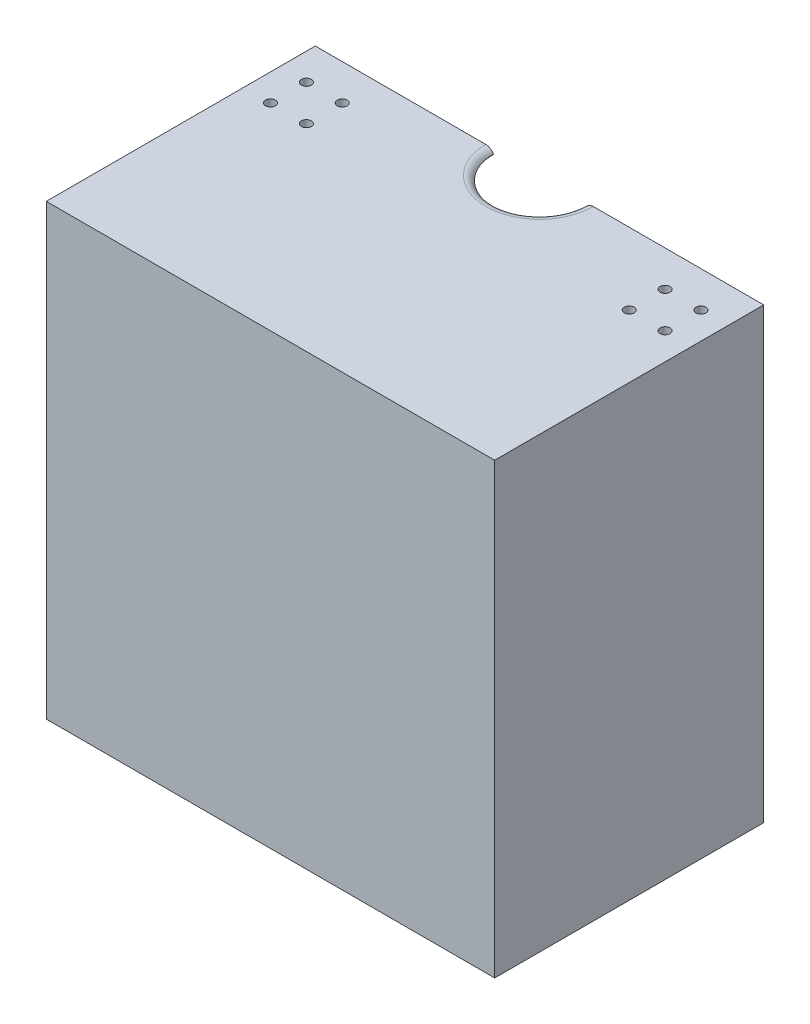
ISO-10303-21;
HEADER;
FILE_DESCRIPTION(('STEP AP214'),'2;1');
FILE_NAME('part.step','',(''),(''),'','','');
FILE_SCHEMA(('AUTOMOTIVE_DESIGN { 1 0 10303 214 1 1 1 1 }'));
ENDSEC;
DATA;
#1=APPLICATION_CONTEXT('core data for automotive mechanical design processes');
#2=APPLICATION_PROTOCOL_DEFINITION('international standard','automotive_design',2000,#1);
#3=PRODUCT_CONTEXT('',#1,'mechanical');
#4=PRODUCT('Part','Part','',(#3));
#5=PRODUCT_RELATED_PRODUCT_CATEGORY('part','',(#4));
#6=PRODUCT_DEFINITION_FORMATION('','',#4);
#7=PRODUCT_DEFINITION_CONTEXT('part definition',#1,'design');
#8=PRODUCT_DEFINITION('design','',#6,#7);
#9=PRODUCT_DEFINITION_SHAPE('','',#8);
#10=(LENGTH_UNIT() NAMED_UNIT(*) SI_UNIT(.MILLI.,.METRE.));
#11=(NAMED_UNIT(*) PLANE_ANGLE_UNIT() SI_UNIT($,.RADIAN.));
#12=(NAMED_UNIT(*) SI_UNIT($,.STERADIAN.) SOLID_ANGLE_UNIT());
#13=UNCERTAINTY_MEASURE_WITH_UNIT(LENGTH_MEASURE(1.E-05),#10,'distance_accuracy_value','');
#14=(GEOMETRIC_REPRESENTATION_CONTEXT(3) GLOBAL_UNCERTAINTY_ASSIGNED_CONTEXT((#13)) GLOBAL_UNIT_ASSIGNED_CONTEXT((#10,
#11,#12)) REPRESENTATION_CONTEXT('',''));
#15=CARTESIAN_POINT('',(0.,0.,0.));
#16=DIRECTION('',(0.,0.,1.));
#17=DIRECTION('',(1.,0.,0.));
#18=AXIS2_PLACEMENT_3D('',#15,#16,#17);
#19=CARTESIAN_POINT('',(-63.5,63.5,76.2));
#20=DIRECTION('',(0.,-1.,0.));
#21=DIRECTION('',(0.,0.,-1.));
#22=AXIS2_PLACEMENT_3D('',#19,#20,#21);
#23=PLANE('',#22);
#24=CARTESIAN_POINT('',(45.72,63.5,20.32));
#25=DIRECTION('',(0.,1.,0.));
#26=DIRECTION('',(0.,0.,-1.));
#27=AXIS2_PLACEMENT_3D('',#24,#25,#26);
#28=CIRCLE('',#27,1.4097);
#29=CARTESIAN_POINT('',(45.72,63.5,18.9103));
#30=VERTEX_POINT('',#29);
#31=EDGE_CURVE('E603',#30,#30,#28,.T.);
#32=ORIENTED_EDGE('',*,*,#31,.F.);
#33=EDGE_LOOP('',(#32));
#34=FACE_BOUND('',#33,.T.);
#35=CARTESIAN_POINT('',(55.88,63.5,10.16));
#36=DIRECTION('',(0.,1.,0.));
#37=DIRECTION('',(0.,0.,-1.));
#38=AXIS2_PLACEMENT_3D('',#35,#36,#37);
#39=CIRCLE('',#38,1.4097);
#40=CARTESIAN_POINT('',(55.88,63.5,8.7503));
#41=VERTEX_POINT('',#40);
#42=EDGE_CURVE('E609',#41,#41,#39,.T.);
#43=ORIENTED_EDGE('',*,*,#42,.F.);
#44=EDGE_LOOP('',(#43));
#45=FACE_BOUND('',#44,.T.);
#46=CARTESIAN_POINT('',(45.72,63.5,10.16));
#47=DIRECTION('',(0.,1.,0.));
#48=DIRECTION('',(0.,0.,-1.));
#49=AXIS2_PLACEMENT_3D('',#46,#47,#48);
#50=CIRCLE('',#49,1.4097);
#51=CARTESIAN_POINT('',(45.72,63.5,8.7503));
#52=VERTEX_POINT('',#51);
#53=EDGE_CURVE('E620',#52,#52,#50,.T.);
#54=ORIENTED_EDGE('',*,*,#53,.F.);
#55=EDGE_LOOP('',(#54));
#56=FACE_BOUND('',#55,.T.);
#57=CARTESIAN_POINT('',(55.88,63.5,20.32));
#58=DIRECTION('',(0.,1.,0.));
#59=DIRECTION('',(0.,0.,-1.));
#60=AXIS2_PLACEMENT_3D('',#57,#58,#59);
#61=CIRCLE('',#60,1.4097);
#62=CARTESIAN_POINT('',(55.88,63.5,18.9103));
#63=VERTEX_POINT('',#62);
#64=EDGE_CURVE('E230',#63,#63,#61,.T.);
#65=ORIENTED_EDGE('',*,*,#64,.F.);
#66=EDGE_LOOP('',(#65));
#67=FACE_BOUND('',#66,.T.);
#68=CARTESIAN_POINT('',(-45.72,63.5,20.32));
#69=DIRECTION('',(0.,-1.,0.));
#70=DIRECTION('',(0.,0.,-1.));
#71=AXIS2_PLACEMENT_3D('',#68,#69,#70);
#72=CIRCLE('',#71,1.4097);
#73=CARTESIAN_POINT('',(-45.72,63.5,18.9103));
#74=VERTEX_POINT('',#73);
#75=EDGE_CURVE('E258',#74,#74,#72,.T.);
#76=ORIENTED_EDGE('',*,*,#75,.T.);
#77=EDGE_LOOP('',(#76));
#78=FACE_BOUND('',#77,.T.);
#79=CARTESIAN_POINT('',(-55.88,63.5,10.16));
#80=DIRECTION('',(0.,-1.,0.));
#81=DIRECTION('',(0.,0.,-1.));
#82=AXIS2_PLACEMENT_3D('',#79,#80,#81);
#83=CIRCLE('',#82,1.4097);
#84=CARTESIAN_POINT('',(-55.88,63.5,8.7503));
#85=VERTEX_POINT('',#84);
#86=EDGE_CURVE('E265',#85,#85,#83,.T.);
#87=ORIENTED_EDGE('',*,*,#86,.T.);
#88=EDGE_LOOP('',(#87));
#89=FACE_BOUND('',#88,.T.);
#90=CARTESIAN_POINT('',(-45.72,63.5,10.16));
#91=DIRECTION('',(0.,-1.,0.));
#92=DIRECTION('',(0.,0.,-1.));
#93=AXIS2_PLACEMENT_3D('',#90,#91,#92);
#94=CIRCLE('',#93,1.4097);
#95=CARTESIAN_POINT('',(-45.72,63.5,8.7503));
#96=VERTEX_POINT('',#95);
#97=EDGE_CURVE('E252',#96,#96,#94,.T.);
#98=ORIENTED_EDGE('',*,*,#97,.T.);
#99=EDGE_LOOP('',(#98));
#100=FACE_BOUND('',#99,.T.);
#101=CARTESIAN_POINT('',(-55.88,63.5,20.32));
#102=DIRECTION('',(0.,-1.,0.));
#103=DIRECTION('',(0.,0.,-1.));
#104=AXIS2_PLACEMENT_3D('',#101,#102,#103);
#105=CIRCLE('',#104,1.4097);
#106=CARTESIAN_POINT('',(-55.88,63.5,18.9103));
#107=VERTEX_POINT('',#106);
#108=EDGE_CURVE('E214',#107,#107,#105,.T.);
#109=ORIENTED_EDGE('',*,*,#108,.T.);
#110=EDGE_LOOP('',(#109));
#111=FACE_BOUND('',#110,.T.);
#112=DIRECTION('',(-1.,0.,0.));
#113=VECTOR('',#112,1.);
#114=CARTESIAN_POINT('',(-63.5,63.5,0.));
#115=LINE('',#114,#113);
#116=CARTESIAN_POINT('',(63.5,63.5,0.));
#117=VERTEX_POINT('',#116);
#118=CARTESIAN_POINT('',(15.24,63.5,0.));
#119=VERTEX_POINT('',#118);
#120=EDGE_CURVE('E182',#117,#119,#115,.T.);
#121=ORIENTED_EDGE('',*,*,#120,.T.);
#122=CARTESIAN_POINT('',(0.,63.5,0.));
#123=DIRECTION('',(0.,-1.,0.));
#124=DIRECTION('',(0.,0.,-1.));
#125=AXIS2_PLACEMENT_3D('',#122,#123,#124);
#126=CIRCLE('',#125,15.24);
#127=CARTESIAN_POINT('',(-15.24,63.5,0.));
#128=VERTEX_POINT('',#127);
#129=EDGE_CURVE('E199',#119,#128,#126,.T.);
#130=ORIENTED_EDGE('',*,*,#129,.T.);
#131=CARTESIAN_POINT('',(-63.5,63.5,0.));
#132=VERTEX_POINT('',#131);
#133=EDGE_CURVE('E148',#128,#132,#115,.T.);
#134=ORIENTED_EDGE('',*,*,#133,.T.);
#135=DIRECTION('',(0.,0.,-1.));
#136=VECTOR('',#135,1.);
#137=CARTESIAN_POINT('',(-63.5,63.5,76.2));
#138=LINE('',#137,#136);
#139=CARTESIAN_POINT('',(-63.5,63.5,76.2));
#140=VERTEX_POINT('',#139);
#141=EDGE_CURVE('E193',#140,#132,#138,.T.);
#142=ORIENTED_EDGE('',*,*,#141,.F.);
#143=DIRECTION('',(-1.,0.,0.));
#144=VECTOR('',#143,1.);
#145=CARTESIAN_POINT('',(-63.5,63.5,76.2));
#146=LINE('',#145,#144);
#147=CARTESIAN_POINT('',(63.5,63.5,76.2));
#148=VERTEX_POINT('',#147);
#149=EDGE_CURVE('E174',#148,#140,#146,.T.);
#150=ORIENTED_EDGE('',*,*,#149,.F.);
#151=DIRECTION('',(0.,0.,-1.));
#152=VECTOR('',#151,1.);
#153=CARTESIAN_POINT('',(63.5,63.5,76.2));
#154=LINE('',#153,#152);
#155=EDGE_CURVE('E196',#148,#117,#154,.T.);
#156=ORIENTED_EDGE('',*,*,#155,.T.);
#157=EDGE_LOOP('',(#121,#130,#134,#142,#150,#156));
#158=FACE_BOUND('',#157,.T.);
#159=ADVANCED_FACE('F37',(#34,#45,#56,#67,#78,#89,#100,#111,#158),#23,.F.);
#160=CARTESIAN_POINT('',(0.,0.,0.));
#161=DIRECTION('',(0.,0.,1.));
#162=DIRECTION('',(1.,0.,0.));
#163=AXIS2_PLACEMENT_3D('',#160,#161,#162);
#164=PLANE('',#163);
#165=ORIENTED_EDGE('',*,*,#133,.F.);
#166=CARTESIAN_POINT('',(-15.24,60.96,0.));
#167=DIRECTION('',(0.,0.,1.));
#168=DIRECTION('',(1.,0.,0.));
#169=AXIS2_PLACEMENT_3D('',#166,#167,#168);
#170=CIRCLE('',#169,2.54);
#171=CARTESIAN_POINT('',(-13.0402954743876,62.23,0.));
#172=VERTEX_POINT('',#171);
#173=EDGE_CURVE('E46',#128,#172,#170,.F.);
#174=ORIENTED_EDGE('',*,*,#173,.T.);
#175=CARTESIAN_POINT('',(-15.24,63.5,0.));
#176=DIRECTION('',(0.,0.,1.));
#177=DIRECTION('',(1.,0.,0.));
#178=AXIS2_PLACEMENT_3D('',#175,#176,#177);
#179=CIRCLE('',#178,2.54);
#180=CARTESIAN_POINT('',(-15.24,60.96,0.));
#181=VERTEX_POINT('',#180);
#182=EDGE_CURVE('E205',#172,#181,#179,.F.);
#183=ORIENTED_EDGE('',*,*,#182,.T.);
#184=DIRECTION('',(-1.,0.,0.));
#185=VECTOR('',#184,1.);
#186=CARTESIAN_POINT('',(-63.5,60.96,0.));
#187=LINE('',#186,#185);
#188=CARTESIAN_POINT('',(-60.96,60.96,0.));
#189=VERTEX_POINT('',#188);
#190=EDGE_CURVE('E163',#181,#189,#187,.T.);
#191=ORIENTED_EDGE('',*,*,#190,.T.);
#192=DIRECTION('',(0.,-1.,0.));
#193=VECTOR('',#192,1.);
#194=CARTESIAN_POINT('',(-60.96,63.5,0.));
#195=LINE('',#194,#193);
#196=CARTESIAN_POINT('',(-60.96,-60.96,0.));
#197=VERTEX_POINT('',#196);
#198=EDGE_CURVE('E167',#189,#197,#195,.T.);
#199=ORIENTED_EDGE('',*,*,#198,.T.);
#200=DIRECTION('',(1.,0.,0.));
#201=VECTOR('',#200,1.);
#202=CARTESIAN_POINT('',(-63.5,-60.96,0.));
#203=LINE('',#202,#201);
#204=CARTESIAN_POINT('',(60.96,-60.96,0.));
#205=VERTEX_POINT('',#204);
#206=EDGE_CURVE('E139',#197,#205,#203,.T.);
#207=ORIENTED_EDGE('',*,*,#206,.T.);
#208=DIRECTION('',(0.,1.,0.));
#209=VECTOR('',#208,1.);
#210=CARTESIAN_POINT('',(60.96,63.5,0.));
#211=LINE('',#210,#209);
#212=CARTESIAN_POINT('',(60.96,60.96,0.));
#213=VERTEX_POINT('',#212);
#214=EDGE_CURVE('E161',#205,#213,#211,.T.);
#215=ORIENTED_EDGE('',*,*,#214,.T.);
#216=CARTESIAN_POINT('',(15.24,60.96,0.));
#217=VERTEX_POINT('',#216);
#218=EDGE_CURVE('E143',#213,#217,#187,.T.);
#219=ORIENTED_EDGE('',*,*,#218,.T.);
#220=CARTESIAN_POINT('',(15.24,63.5,0.));
#221=DIRECTION('',(0.,0.,1.));
#222=DIRECTION('',(1.,0.,0.));
#223=AXIS2_PLACEMENT_3D('',#220,#221,#222);
#224=CIRCLE('',#223,2.54);
#225=CARTESIAN_POINT('',(13.0402954743875,62.23,0.));
#226=VERTEX_POINT('',#225);
#227=EDGE_CURVE('E60',#217,#226,#224,.F.);
#228=ORIENTED_EDGE('',*,*,#227,.T.);
#229=CARTESIAN_POINT('',(15.24,60.96,0.));
#230=DIRECTION('',(0.,0.,1.));
#231=DIRECTION('',(1.,0.,0.));
#232=AXIS2_PLACEMENT_3D('',#229,#230,#231);
#233=CIRCLE('',#232,2.54);
#234=EDGE_CURVE('E203',#226,#119,#233,.F.);
#235=ORIENTED_EDGE('',*,*,#234,.T.);
#236=ORIENTED_EDGE('',*,*,#120,.F.);
#237=DIRECTION('',(0.,1.,0.));
#238=VECTOR('',#237,1.);
#239=CARTESIAN_POINT('',(63.5,63.5,0.));
#240=LINE('',#239,#238);
#241=CARTESIAN_POINT('',(63.5,-63.5,0.));
#242=VERTEX_POINT('',#241);
#243=EDGE_CURVE('E144',#242,#117,#240,.T.);
#244=ORIENTED_EDGE('',*,*,#243,.F.);
#245=DIRECTION('',(1.,0.,0.));
#246=VECTOR('',#245,1.);
#247=CARTESIAN_POINT('',(-63.5,-63.5,0.));
#248=LINE('',#247,#246);
#249=CARTESIAN_POINT('',(-63.5,-63.5,0.));
#250=VERTEX_POINT('',#249);
#251=EDGE_CURVE('E175',#250,#242,#248,.T.);
#252=ORIENTED_EDGE('',*,*,#251,.F.);
#253=DIRECTION('',(0.,-1.,0.));
#254=VECTOR('',#253,1.);
#255=CARTESIAN_POINT('',(-63.5,63.5,0.));
#256=LINE('',#255,#254);
#257=EDGE_CURVE('E185',#132,#250,#256,.T.);
#258=ORIENTED_EDGE('',*,*,#257,.F.);
#259=EDGE_LOOP('',(#165,#174,#183,#191,#199,#207,#215,#219,#228,#235,#236,#244,#252,#258));
#260=FACE_BOUND('',#259,.T.);
#261=ADVANCED_FACE('F303',(#260),#164,.F.);
#262=CARTESIAN_POINT('',(63.5,63.5,76.2));
#263=DIRECTION('',(-1.,0.,0.));
#264=DIRECTION('',(0.,-1.,0.));
#265=AXIS2_PLACEMENT_3D('',#262,#263,#264);
#266=PLANE('',#265);
#267=ORIENTED_EDGE('',*,*,#243,.T.);
#268=ORIENTED_EDGE('',*,*,#155,.F.);
#269=DIRECTION('',(0.,1.,0.));
#270=VECTOR('',#269,1.);
#271=CARTESIAN_POINT('',(63.5,63.5,76.2));
#272=LINE('',#271,#270);
#273=CARTESIAN_POINT('',(63.5,-63.5,76.2));
#274=VERTEX_POINT('',#273);
#275=EDGE_CURVE('E171',#274,#148,#272,.T.);
#276=ORIENTED_EDGE('',*,*,#275,.F.);
#277=DIRECTION('',(0.,0.,-1.));
#278=VECTOR('',#277,1.);
#279=CARTESIAN_POINT('',(63.5,-63.5,76.2));
#280=LINE('',#279,#278);
#281=EDGE_CURVE('E180',#274,#242,#280,.T.);
#282=ORIENTED_EDGE('',*,*,#281,.T.);
#283=EDGE_LOOP('',(#267,#268,#276,#282));
#284=FACE_BOUND('',#283,.T.);
#285=ADVANCED_FACE('F338',(#284),#266,.F.);
#286=CARTESIAN_POINT('',(-63.5,63.5,76.2));
#287=DIRECTION('',(1.,0.,0.));
#288=DIRECTION('',(0.,0.,-1.));
#289=AXIS2_PLACEMENT_3D('',#286,#287,#288);
#290=PLANE('',#289);
#291=ORIENTED_EDGE('',*,*,#257,.T.);
#292=DIRECTION('',(0.,0.,-1.));
#293=VECTOR('',#292,1.);
#294=CARTESIAN_POINT('',(-63.5,-63.5,76.2));
#295=LINE('',#294,#293);
#296=CARTESIAN_POINT('',(-63.5,-63.5,76.2));
#297=VERTEX_POINT('',#296);
#298=EDGE_CURVE('E190',#297,#250,#295,.T.);
#299=ORIENTED_EDGE('',*,*,#298,.F.);
#300=DIRECTION('',(0.,-1.,0.));
#301=VECTOR('',#300,1.);
#302=CARTESIAN_POINT('',(-63.5,63.5,76.2));
#303=LINE('',#302,#301);
#304=EDGE_CURVE('E177',#140,#297,#303,.T.);
#305=ORIENTED_EDGE('',*,*,#304,.F.);
#306=ORIENTED_EDGE('',*,*,#141,.T.);
#307=EDGE_LOOP('',(#291,#299,#305,#306));
#308=FACE_BOUND('',#307,.T.);
#309=ADVANCED_FACE('F341',(#308),#290,.F.);
#310=CARTESIAN_POINT('',(-63.5,-63.5,76.2));
#311=DIRECTION('',(0.,1.,0.));
#312=DIRECTION('',(0.,0.,1.));
#313=AXIS2_PLACEMENT_3D('',#310,#311,#312);
#314=PLANE('',#313);
#315=CARTESIAN_POINT('',(45.72,-63.5,20.32));
#316=DIRECTION('',(0.,1.,0.));
#317=DIRECTION('',(0.,0.,-1.));
#318=AXIS2_PLACEMENT_3D('',#315,#316,#317);
#319=CIRCLE('',#318,1.4097);
#320=CARTESIAN_POINT('',(45.72,-63.5,18.9103));
#321=VERTEX_POINT('',#320);
#322=EDGE_CURVE('E605',#321,#321,#319,.T.);
#323=ORIENTED_EDGE('',*,*,#322,.T.);
#324=EDGE_LOOP('',(#323));
#325=FACE_BOUND('',#324,.T.);
#326=CARTESIAN_POINT('',(55.88,-63.5,10.16));
#327=DIRECTION('',(0.,1.,0.));
#328=DIRECTION('',(0.,0.,-1.));
#329=AXIS2_PLACEMENT_3D('',#326,#327,#328);
#330=CIRCLE('',#329,1.4097);
#331=CARTESIAN_POINT('',(55.88,-63.5,8.7503));
#332=VERTEX_POINT('',#331);
#333=EDGE_CURVE('E617',#332,#332,#330,.T.);
#334=ORIENTED_EDGE('',*,*,#333,.T.);
#335=EDGE_LOOP('',(#334));
#336=FACE_BOUND('',#335,.T.);
#337=CARTESIAN_POINT('',(45.72,-63.5,10.16));
#338=DIRECTION('',(0.,1.,0.));
#339=DIRECTION('',(0.,0.,-1.));
#340=AXIS2_PLACEMENT_3D('',#337,#338,#339);
#341=CIRCLE('',#340,1.4097);
#342=CARTESIAN_POINT('',(45.72,-63.5,8.7503));
#343=VERTEX_POINT('',#342);
#344=EDGE_CURVE('E612',#343,#343,#341,.T.);
#345=ORIENTED_EDGE('',*,*,#344,.T.);
#346=EDGE_LOOP('',(#345));
#347=FACE_BOUND('',#346,.T.);
#348=CARTESIAN_POINT('',(55.88,-63.5,20.32));
#349=DIRECTION('',(0.,1.,0.));
#350=DIRECTION('',(0.,0.,-1.));
#351=AXIS2_PLACEMENT_3D('',#348,#349,#350);
#352=CIRCLE('',#351,1.4097);
#353=CARTESIAN_POINT('',(55.88,-63.5,18.9103));
#354=VERTEX_POINT('',#353);
#355=EDGE_CURVE('E604',#354,#354,#352,.T.);
#356=ORIENTED_EDGE('',*,*,#355,.T.);
#357=EDGE_LOOP('',(#356));
#358=FACE_BOUND('',#357,.T.);
#359=CARTESIAN_POINT('',(-45.72,-63.5,20.32));
#360=DIRECTION('',(0.,-1.,0.));
#361=DIRECTION('',(0.,0.,-1.));
#362=AXIS2_PLACEMENT_3D('',#359,#360,#361);
#363=CIRCLE('',#362,1.4097);
#364=CARTESIAN_POINT('',(-45.72,-63.5,18.9103));
#365=VERTEX_POINT('',#364);
#366=EDGE_CURVE('E262',#365,#365,#363,.T.);
#367=ORIENTED_EDGE('',*,*,#366,.F.);
#368=EDGE_LOOP('',(#367));
#369=FACE_BOUND('',#368,.T.);
#370=CARTESIAN_POINT('',(-55.88,-63.5,10.16));
#371=DIRECTION('',(0.,-1.,0.));
#372=DIRECTION('',(0.,0.,-1.));
#373=AXIS2_PLACEMENT_3D('',#370,#371,#372);
#374=CIRCLE('',#373,1.4097);
#375=CARTESIAN_POINT('',(-55.88,-63.5,8.7503));
#376=VERTEX_POINT('',#375);
#377=EDGE_CURVE('E255',#376,#376,#374,.T.);
#378=ORIENTED_EDGE('',*,*,#377,.F.);
#379=EDGE_LOOP('',(#378));
#380=FACE_BOUND('',#379,.T.);
#381=CARTESIAN_POINT('',(-45.72,-63.5,10.16));
#382=DIRECTION('',(0.,-1.,0.));
#383=DIRECTION('',(0.,0.,-1.));
#384=AXIS2_PLACEMENT_3D('',#381,#382,#383);
#385=CIRCLE('',#384,1.4097);
#386=CARTESIAN_POINT('',(-45.72,-63.5,8.7503));
#387=VERTEX_POINT('',#386);
#388=EDGE_CURVE('E251',#387,#387,#385,.T.);
#389=ORIENTED_EDGE('',*,*,#388,.F.);
#390=EDGE_LOOP('',(#389));
#391=FACE_BOUND('',#390,.T.);
#392=CARTESIAN_POINT('',(-55.88,-63.5,20.32));
#393=DIRECTION('',(0.,-1.,0.));
#394=DIRECTION('',(0.,0.,-1.));
#395=AXIS2_PLACEMENT_3D('',#392,#393,#394);
#396=CIRCLE('',#395,1.4097);
#397=CARTESIAN_POINT('',(-55.88,-63.5,18.9103));
#398=VERTEX_POINT('',#397);
#399=EDGE_CURVE('E261',#398,#398,#396,.T.);
#400=ORIENTED_EDGE('',*,*,#399,.F.);
#401=EDGE_LOOP('',(#400));
#402=FACE_BOUND('',#401,.T.);
#403=ORIENTED_EDGE('',*,*,#251,.T.);
#404=ORIENTED_EDGE('',*,*,#281,.F.);
#405=DIRECTION('',(1.,0.,0.));
#406=VECTOR('',#405,1.);
#407=CARTESIAN_POINT('',(-63.5,-63.5,76.2));
#408=LINE('',#407,#406);
#409=EDGE_CURVE('E179',#297,#274,#408,.T.);
#410=ORIENTED_EDGE('',*,*,#409,.F.);
#411=ORIENTED_EDGE('',*,*,#298,.T.);
#412=EDGE_LOOP('',(#403,#404,#410,#411));
#413=FACE_BOUND('',#412,.T.);
#414=ADVANCED_FACE('F334',(#325,#336,#347,#358,#369,#380,#391,#402,#413),#314,.F.);
#415=CARTESIAN_POINT('',(0.,0.,76.2));
#416=DIRECTION('',(0.,0.,1.));
#417=DIRECTION('',(1.,0.,0.));
#418=AXIS2_PLACEMENT_3D('',#415,#416,#417);
#419=PLANE('',#418);
#420=ORIENTED_EDGE('',*,*,#275,.T.);
#421=ORIENTED_EDGE('',*,*,#149,.T.);
#422=ORIENTED_EDGE('',*,*,#304,.T.);
#423=ORIENTED_EDGE('',*,*,#409,.T.);
#424=EDGE_LOOP('',(#420,#421,#422,#423));
#425=FACE_BOUND('',#424,.T.);
#426=ADVANCED_FACE('F331',(#425),#419,.T.);
#427=CARTESIAN_POINT('',(60.96,63.5,76.2));
#428=DIRECTION('',(-1.,0.,0.));
#429=DIRECTION('',(0.,-1.,0.));
#430=AXIS2_PLACEMENT_3D('',#427,#428,#429);
#431=PLANE('',#430);
#432=ORIENTED_EDGE('',*,*,#214,.F.);
#433=DIRECTION('',(0.,0.,-1.));
#434=VECTOR('',#433,1.);
#435=CARTESIAN_POINT('',(60.96,-60.96,76.2));
#436=LINE('',#435,#434);
#437=CARTESIAN_POINT('',(60.96,-60.96,73.66));
#438=VERTEX_POINT('',#437);
#439=EDGE_CURVE('E138',#438,#205,#436,.T.);
#440=ORIENTED_EDGE('',*,*,#439,.F.);
#441=DIRECTION('',(0.,1.,0.));
#442=VECTOR('',#441,1.);
#443=CARTESIAN_POINT('',(60.96,63.5,73.66));
#444=LINE('',#443,#442);
#445=CARTESIAN_POINT('',(60.96,60.96,73.66));
#446=VERTEX_POINT('',#445);
#447=EDGE_CURVE('E124',#438,#446,#444,.T.);
#448=ORIENTED_EDGE('',*,*,#447,.T.);
#449=DIRECTION('',(0.,0.,-1.));
#450=VECTOR('',#449,1.);
#451=CARTESIAN_POINT('',(60.96,60.96,76.2));
#452=LINE('',#451,#450);
#453=EDGE_CURVE('E136',#446,#213,#452,.T.);
#454=ORIENTED_EDGE('',*,*,#453,.T.);
#455=EDGE_LOOP('',(#432,#440,#448,#454));
#456=FACE_BOUND('',#455,.T.);
#457=ADVANCED_FACE('F135',(#456),#431,.T.);
#458=CARTESIAN_POINT('',(-63.5,60.96,76.2));
#459=DIRECTION('',(0.,-1.,0.));
#460=DIRECTION('',(0.,0.,-1.));
#461=AXIS2_PLACEMENT_3D('',#458,#459,#460);
#462=PLANE('',#461);
#463=CARTESIAN_POINT('',(45.72,60.96,20.32));
#464=DIRECTION('',(0.,-1.,0.));
#465=DIRECTION('',(0.,0.,-1.));
#466=AXIS2_PLACEMENT_3D('',#463,#464,#465);
#467=CIRCLE('',#466,1.4097);
#468=CARTESIAN_POINT('',(45.72,60.96,18.9103));
#469=VERTEX_POINT('',#468);
#470=EDGE_CURVE('E248',#469,#469,#467,.F.);
#471=ORIENTED_EDGE('',*,*,#470,.T.);
#472=EDGE_LOOP('',(#471));
#473=FACE_BOUND('',#472,.T.);
#474=CARTESIAN_POINT('',(55.88,60.96,10.16));
#475=DIRECTION('',(0.,-1.,0.));
#476=DIRECTION('',(0.,0.,-1.));
#477=AXIS2_PLACEMENT_3D('',#474,#475,#476);
#478=CIRCLE('',#477,1.4097);
#479=CARTESIAN_POINT('',(55.88,60.96,8.7503));
#480=VERTEX_POINT('',#479);
#481=EDGE_CURVE('E236',#480,#480,#478,.F.);
#482=ORIENTED_EDGE('',*,*,#481,.T.);
#483=EDGE_LOOP('',(#482));
#484=FACE_BOUND('',#483,.T.);
#485=CARTESIAN_POINT('',(45.72,60.96,10.16));
#486=DIRECTION('',(0.,-1.,0.));
#487=DIRECTION('',(0.,0.,-1.));
#488=AXIS2_PLACEMENT_3D('',#485,#486,#487);
#489=CIRCLE('',#488,1.4097);
#490=CARTESIAN_POINT('',(45.72,60.96,8.7503));
#491=VERTEX_POINT('',#490);
#492=EDGE_CURVE('E233',#491,#491,#489,.F.);
#493=ORIENTED_EDGE('',*,*,#492,.T.);
#494=EDGE_LOOP('',(#493));
#495=FACE_BOUND('',#494,.T.);
#496=CARTESIAN_POINT('',(55.88,60.96,20.32));
#497=DIRECTION('',(0.,-1.,0.));
#498=DIRECTION('',(0.,0.,-1.));
#499=AXIS2_PLACEMENT_3D('',#496,#497,#498);
#500=CIRCLE('',#499,1.4097);
#501=CARTESIAN_POINT('',(55.88,60.96,18.9103));
#502=VERTEX_POINT('',#501);
#503=EDGE_CURVE('E229',#502,#502,#500,.F.);
#504=ORIENTED_EDGE('',*,*,#503,.T.);
#505=EDGE_LOOP('',(#504));
#506=FACE_BOUND('',#505,.T.);
#507=CARTESIAN_POINT('',(-45.72,60.96,20.32));
#508=DIRECTION('',(0.,-1.,0.));
#509=DIRECTION('',(0.,0.,-1.));
#510=AXIS2_PLACEMENT_3D('',#507,#508,#509);
#511=CIRCLE('',#510,1.4097);
#512=CARTESIAN_POINT('',(-45.72,60.96,18.9103));
#513=VERTEX_POINT('',#512);
#514=EDGE_CURVE('E153',#513,#513,#511,.T.);
#515=ORIENTED_EDGE('',*,*,#514,.F.);
#516=EDGE_LOOP('',(#515));
#517=FACE_BOUND('',#516,.T.);
#518=CARTESIAN_POINT('',(-55.88,60.96,10.16));
#519=DIRECTION('',(0.,-1.,0.));
#520=DIRECTION('',(0.,0.,-1.));
#521=AXIS2_PLACEMENT_3D('',#518,#519,#520);
#522=CIRCLE('',#521,1.4097);
#523=CARTESIAN_POINT('',(-55.88,60.96,8.7503));
#524=VERTEX_POINT('',#523);
#525=EDGE_CURVE('E222',#524,#524,#522,.T.);
#526=ORIENTED_EDGE('',*,*,#525,.F.);
#527=EDGE_LOOP('',(#526));
#528=FACE_BOUND('',#527,.T.);
#529=CARTESIAN_POINT('',(-45.72,60.96,10.16));
#530=DIRECTION('',(0.,-1.,0.));
#531=DIRECTION('',(0.,0.,-1.));
#532=AXIS2_PLACEMENT_3D('',#529,#530,#531);
#533=CIRCLE('',#532,1.4097);
#534=CARTESIAN_POINT('',(-45.72,60.96,8.7503));
#535=VERTEX_POINT('',#534);
#536=EDGE_CURVE('E218',#535,#535,#533,.T.);
#537=ORIENTED_EDGE('',*,*,#536,.F.);
#538=EDGE_LOOP('',(#537));
#539=FACE_BOUND('',#538,.T.);
#540=CARTESIAN_POINT('',(-55.88,60.96,20.32));
#541=DIRECTION('',(0.,-1.,0.));
#542=DIRECTION('',(0.,0.,-1.));
#543=AXIS2_PLACEMENT_3D('',#540,#541,#542);
#544=CIRCLE('',#543,1.4097);
#545=CARTESIAN_POINT('',(-55.88,60.96,18.9103));
#546=VERTEX_POINT('',#545);
#547=EDGE_CURVE('E213',#546,#546,#544,.T.);
#548=ORIENTED_EDGE('',*,*,#547,.F.);
#549=EDGE_LOOP('',(#548));
#550=FACE_BOUND('',#549,.T.);
#551=ORIENTED_EDGE('',*,*,#190,.F.);
#552=CARTESIAN_POINT('',(0.,60.96,0.));
#553=DIRECTION('',(0.,-1.,0.));
#554=DIRECTION('',(0.,0.,-1.));
#555=AXIS2_PLACEMENT_3D('',#552,#553,#554);
#556=CIRCLE('',#555,15.24);
#557=EDGE_CURVE('E11',#181,#217,#556,.F.);
#558=ORIENTED_EDGE('',*,*,#557,.T.);
#559=ORIENTED_EDGE('',*,*,#218,.F.);
#560=ORIENTED_EDGE('',*,*,#453,.F.);
#561=DIRECTION('',(-1.,0.,0.));
#562=VECTOR('',#561,1.);
#563=CARTESIAN_POINT('',(-63.5,60.96,73.66));
#564=LINE('',#563,#562);
#565=CARTESIAN_POINT('',(-60.96,60.96,73.66));
#566=VERTEX_POINT('',#565);
#567=EDGE_CURVE('E120',#446,#566,#564,.T.);
#568=ORIENTED_EDGE('',*,*,#567,.T.);
#569=DIRECTION('',(0.,0.,-1.));
#570=VECTOR('',#569,1.);
#571=CARTESIAN_POINT('',(-60.96,60.96,76.2));
#572=LINE('',#571,#570);
#573=EDGE_CURVE('E145',#566,#189,#572,.T.);
#574=ORIENTED_EDGE('',*,*,#573,.T.);
#575=EDGE_LOOP('',(#551,#558,#559,#560,#568,#574));
#576=FACE_BOUND('',#575,.T.);
#577=ADVANCED_FACE('F142',(#473,#484,#495,#506,#517,#528,#539,#550,#576),#462,.T.);
#578=CARTESIAN_POINT('',(-60.96,63.5,76.2));
#579=DIRECTION('',(1.,0.,0.));
#580=DIRECTION('',(0.,0.,-1.));
#581=AXIS2_PLACEMENT_3D('',#578,#579,#580);
#582=PLANE('',#581);
#583=ORIENTED_EDGE('',*,*,#198,.F.);
#584=ORIENTED_EDGE('',*,*,#573,.F.);
#585=DIRECTION('',(0.,-1.,0.));
#586=VECTOR('',#585,1.);
#587=CARTESIAN_POINT('',(-60.96,63.5,73.66));
#588=LINE('',#587,#586);
#589=CARTESIAN_POINT('',(-60.96,-60.96,73.66));
#590=VERTEX_POINT('',#589);
#591=EDGE_CURVE('E125',#566,#590,#588,.T.);
#592=ORIENTED_EDGE('',*,*,#591,.T.);
#593=DIRECTION('',(0.,0.,-1.));
#594=VECTOR('',#593,1.);
#595=CARTESIAN_POINT('',(-60.96,-60.96,76.2));
#596=LINE('',#595,#594);
#597=EDGE_CURVE('E150',#590,#197,#596,.T.);
#598=ORIENTED_EDGE('',*,*,#597,.T.);
#599=EDGE_LOOP('',(#583,#584,#592,#598));
#600=FACE_BOUND('',#599,.T.);
#601=ADVANCED_FACE('F285',(#600),#582,.T.);
#602=CARTESIAN_POINT('',(-63.5,-60.96,76.2));
#603=DIRECTION('',(0.,1.,0.));
#604=DIRECTION('',(0.,0.,1.));
#605=AXIS2_PLACEMENT_3D('',#602,#603,#604);
#606=PLANE('',#605);
#607=CARTESIAN_POINT('',(45.72,-60.96,20.32));
#608=DIRECTION('',(0.,1.,0.));
#609=DIRECTION('',(0.,0.,1.));
#610=AXIS2_PLACEMENT_3D('',#607,#608,#609);
#611=CIRCLE('',#610,1.4097);
#612=CARTESIAN_POINT('',(45.72,-60.96,21.7297));
#613=VERTEX_POINT('',#612);
#614=EDGE_CURVE('E41',#613,#613,#611,.F.);
#615=ORIENTED_EDGE('',*,*,#614,.T.);
#616=EDGE_LOOP('',(#615));
#617=FACE_BOUND('',#616,.T.);
#618=CARTESIAN_POINT('',(55.88,-60.96,10.16));
#619=DIRECTION('',(0.,1.,0.));
#620=DIRECTION('',(0.,0.,1.));
#621=AXIS2_PLACEMENT_3D('',#618,#619,#620);
#622=CIRCLE('',#621,1.4097);
#623=CARTESIAN_POINT('',(55.88,-60.96,11.5697));
#624=VERTEX_POINT('',#623);
#625=EDGE_CURVE('E234',#624,#624,#622,.F.);
#626=ORIENTED_EDGE('',*,*,#625,.T.);
#627=EDGE_LOOP('',(#626));
#628=FACE_BOUND('',#627,.T.);
#629=CARTESIAN_POINT('',(45.72,-60.96,10.16));
#630=DIRECTION('',(0.,1.,0.));
#631=DIRECTION('',(0.,0.,1.));
#632=AXIS2_PLACEMENT_3D('',#629,#630,#631);
#633=CIRCLE('',#632,1.4097);
#634=CARTESIAN_POINT('',(45.72,-60.96,11.5697));
#635=VERTEX_POINT('',#634);
#636=EDGE_CURVE('E231',#635,#635,#633,.F.);
#637=ORIENTED_EDGE('',*,*,#636,.T.);
#638=EDGE_LOOP('',(#637));
#639=FACE_BOUND('',#638,.T.);
#640=CARTESIAN_POINT('',(55.88,-60.96,20.32));
#641=DIRECTION('',(0.,1.,0.));
#642=DIRECTION('',(0.,0.,1.));
#643=AXIS2_PLACEMENT_3D('',#640,#641,#642);
#644=CIRCLE('',#643,1.4097);
#645=CARTESIAN_POINT('',(55.88,-60.96,21.7297));
#646=VERTEX_POINT('',#645);
#647=EDGE_CURVE('E226',#646,#646,#644,.F.);
#648=ORIENTED_EDGE('',*,*,#647,.T.);
#649=EDGE_LOOP('',(#648));
#650=FACE_BOUND('',#649,.T.);
#651=CARTESIAN_POINT('',(-45.72,-60.96,20.32));
#652=DIRECTION('',(0.,1.,0.));
#653=DIRECTION('',(0.,0.,1.));
#654=AXIS2_PLACEMENT_3D('',#651,#652,#653);
#655=CIRCLE('',#654,1.4097);
#656=CARTESIAN_POINT('',(-45.72,-60.96,21.7297));
#657=VERTEX_POINT('',#656);
#658=EDGE_CURVE('E223',#657,#657,#655,.T.);
#659=ORIENTED_EDGE('',*,*,#658,.F.);
#660=EDGE_LOOP('',(#659));
#661=FACE_BOUND('',#660,.T.);
#662=CARTESIAN_POINT('',(-55.88,-60.96,10.16));
#663=DIRECTION('',(0.,1.,0.));
#664=DIRECTION('',(0.,0.,1.));
#665=AXIS2_PLACEMENT_3D('',#662,#663,#664);
#666=CIRCLE('',#665,1.4097);
#667=CARTESIAN_POINT('',(-55.88,-60.96,11.5697));
#668=VERTEX_POINT('',#667);
#669=EDGE_CURVE('E219',#668,#668,#666,.T.);
#670=ORIENTED_EDGE('',*,*,#669,.F.);
#671=EDGE_LOOP('',(#670));
#672=FACE_BOUND('',#671,.T.);
#673=CARTESIAN_POINT('',(-45.72,-60.96,10.16));
#674=DIRECTION('',(0.,1.,0.));
#675=DIRECTION('',(0.,0.,1.));
#676=AXIS2_PLACEMENT_3D('',#673,#674,#675);
#677=CIRCLE('',#676,1.4097);
#678=CARTESIAN_POINT('',(-45.72,-60.96,11.5697));
#679=VERTEX_POINT('',#678);
#680=EDGE_CURVE('E215',#679,#679,#677,.T.);
#681=ORIENTED_EDGE('',*,*,#680,.F.);
#682=EDGE_LOOP('',(#681));
#683=FACE_BOUND('',#682,.T.);
#684=CARTESIAN_POINT('',(-55.88,-60.96,20.32));
#685=DIRECTION('',(0.,1.,0.));
#686=DIRECTION('',(0.,0.,1.));
#687=AXIS2_PLACEMENT_3D('',#684,#685,#686);
#688=CIRCLE('',#687,1.4097);
#689=CARTESIAN_POINT('',(-55.88,-60.96,21.7297));
#690=VERTEX_POINT('',#689);
#691=EDGE_CURVE('E210',#690,#690,#688,.T.);
#692=ORIENTED_EDGE('',*,*,#691,.F.);
#693=EDGE_LOOP('',(#692));
#694=FACE_BOUND('',#693,.T.);
#695=ORIENTED_EDGE('',*,*,#206,.F.);
#696=ORIENTED_EDGE('',*,*,#597,.F.);
#697=DIRECTION('',(1.,0.,0.));
#698=VECTOR('',#697,1.);
#699=CARTESIAN_POINT('',(-63.5,-60.96,73.66));
#700=LINE('',#699,#698);
#701=EDGE_CURVE('E156',#590,#438,#700,.T.);
#702=ORIENTED_EDGE('',*,*,#701,.T.);
#703=ORIENTED_EDGE('',*,*,#439,.T.);
#704=EDGE_LOOP('',(#695,#696,#702,#703));
#705=FACE_BOUND('',#704,.T.);
#706=ADVANCED_FACE('F319',(#617,#628,#639,#650,#661,#672,#683,#694,#705),#606,.T.);
#707=CARTESIAN_POINT('',(0.,0.,73.66));
#708=DIRECTION('',(0.,0.,1.));
#709=DIRECTION('',(1.,0.,0.));
#710=AXIS2_PLACEMENT_3D('',#707,#708,#709);
#711=PLANE('',#710);
#712=ORIENTED_EDGE('',*,*,#447,.F.);
#713=ORIENTED_EDGE('',*,*,#701,.F.);
#714=ORIENTED_EDGE('',*,*,#591,.F.);
#715=ORIENTED_EDGE('',*,*,#567,.F.);
#716=EDGE_LOOP('',(#712,#713,#714,#715));
#717=FACE_BOUND('',#716,.T.);
#718=ADVANCED_FACE('F122',(#717),#711,.F.);
#719=CARTESIAN_POINT('',(0.,63.5,0.));
#720=DIRECTION('',(0.,-1.,0.));
#721=DIRECTION('',(0.,0.,-1.));
#722=AXIS2_PLACEMENT_3D('',#719,#720,#721);
#723=TOROIDAL_SURFACE('',#722,15.24,2.54);
#724=CARTESIAN_POINT('',(0.,62.23,0.));
#725=DIRECTION('',(0.,-1.,0.));
#726=DIRECTION('',(0.,0.,-1.));
#727=AXIS2_PLACEMENT_3D('',#724,#725,#726);
#728=CIRCLE('',#727,13.0402954743875);
#729=EDGE_CURVE('E164',#226,#172,#728,.T.);
#730=ORIENTED_EDGE('',*,*,#729,.F.);
#731=ORIENTED_EDGE('',*,*,#227,.F.);
#732=ORIENTED_EDGE('',*,*,#557,.F.);
#733=ORIENTED_EDGE('',*,*,#182,.F.);
#734=EDGE_LOOP('',(#730,#731,#732,#733));
#735=FACE_BOUND('',#734,.T.);
#736=ADVANCED_FACE('F39',(#735),#723,.T.);
#737=CARTESIAN_POINT('',(0.,60.96,0.));
#738=DIRECTION('',(0.,-1.,0.));
#739=DIRECTION('',(0.,0.,-1.));
#740=AXIS2_PLACEMENT_3D('',#737,#738,#739);
#741=TOROIDAL_SURFACE('',#740,15.24,2.54);
#742=ORIENTED_EDGE('',*,*,#234,.F.);
#743=ORIENTED_EDGE('',*,*,#729,.T.);
#744=ORIENTED_EDGE('',*,*,#173,.F.);
#745=ORIENTED_EDGE('',*,*,#129,.F.);
#746=EDGE_LOOP('',(#742,#743,#744,#745));
#747=FACE_BOUND('',#746,.T.);
#748=ADVANCED_FACE('F311',(#747),#741,.T.);
#749=CARTESIAN_POINT('',(-55.88,63.5,20.32));
#750=DIRECTION('',(0.,-1.,0.));
#751=DIRECTION('',(0.,0.,-1.));
#752=AXIS2_PLACEMENT_3D('',#749,#750,#751);
#753=CYLINDRICAL_SURFACE('',#752,1.4097);
#754=ORIENTED_EDGE('',*,*,#691,.T.);
#755=EDGE_LOOP('',(#754));
#756=FACE_BOUND('',#755,.T.);
#757=ORIENTED_EDGE('',*,*,#399,.T.);
#758=EDGE_LOOP('',(#757));
#759=FACE_BOUND('',#758,.T.);
#760=ADVANCED_FACE('F298',(#756,#759),#753,.F.);
#761=CARTESIAN_POINT('',(-45.72,63.5,10.16));
#762=DIRECTION('',(0.,-1.,0.));
#763=DIRECTION('',(0.,0.,-1.));
#764=AXIS2_PLACEMENT_3D('',#761,#762,#763);
#765=CYLINDRICAL_SURFACE('',#764,1.4097);
#766=ORIENTED_EDGE('',*,*,#680,.T.);
#767=EDGE_LOOP('',(#766));
#768=FACE_BOUND('',#767,.T.);
#769=ORIENTED_EDGE('',*,*,#388,.T.);
#770=EDGE_LOOP('',(#769));
#771=FACE_BOUND('',#770,.T.);
#772=ADVANCED_FACE('F353',(#768,#771),#765,.F.);
#773=CARTESIAN_POINT('',(-55.88,63.5,10.16));
#774=DIRECTION('',(0.,-1.,0.));
#775=DIRECTION('',(0.,0.,-1.));
#776=AXIS2_PLACEMENT_3D('',#773,#774,#775);
#777=CYLINDRICAL_SURFACE('',#776,1.4097);
#778=ORIENTED_EDGE('',*,*,#669,.T.);
#779=EDGE_LOOP('',(#778));
#780=FACE_BOUND('',#779,.T.);
#781=ORIENTED_EDGE('',*,*,#377,.T.);
#782=EDGE_LOOP('',(#781));
#783=FACE_BOUND('',#782,.T.);
#784=ADVANCED_FACE('F494',(#780,#783),#777,.F.);
#785=CARTESIAN_POINT('',(-45.72,63.5,20.32));
#786=DIRECTION('',(0.,-1.,0.));
#787=DIRECTION('',(0.,0.,-1.));
#788=AXIS2_PLACEMENT_3D('',#785,#786,#787);
#789=CYLINDRICAL_SURFACE('',#788,1.4097);
#790=ORIENTED_EDGE('',*,*,#658,.T.);
#791=EDGE_LOOP('',(#790));
#792=FACE_BOUND('',#791,.T.);
#793=ORIENTED_EDGE('',*,*,#366,.T.);
#794=EDGE_LOOP('',(#793));
#795=FACE_BOUND('',#794,.T.);
#796=ADVANCED_FACE('F296',(#792,#795),#789,.F.);
#797=ORIENTED_EDGE('',*,*,#547,.T.);
#798=EDGE_LOOP('',(#797));
#799=FACE_BOUND('',#798,.T.);
#800=ORIENTED_EDGE('',*,*,#108,.F.);
#801=EDGE_LOOP('',(#800));
#802=FACE_BOUND('',#801,.T.);
#803=ADVANCED_FACE('F292',(#799,#802),#753,.F.);
#804=ORIENTED_EDGE('',*,*,#536,.T.);
#805=EDGE_LOOP('',(#804));
#806=FACE_BOUND('',#805,.T.);
#807=ORIENTED_EDGE('',*,*,#97,.F.);
#808=EDGE_LOOP('',(#807));
#809=FACE_BOUND('',#808,.T.);
#810=ADVANCED_FACE('F295',(#806,#809),#765,.F.);
#811=ORIENTED_EDGE('',*,*,#525,.T.);
#812=EDGE_LOOP('',(#811));
#813=FACE_BOUND('',#812,.T.);
#814=ORIENTED_EDGE('',*,*,#86,.F.);
#815=EDGE_LOOP('',(#814));
#816=FACE_BOUND('',#815,.T.);
#817=ADVANCED_FACE('F280',(#813,#816),#777,.F.);
#818=ORIENTED_EDGE('',*,*,#514,.T.);
#819=EDGE_LOOP('',(#818));
#820=FACE_BOUND('',#819,.T.);
#821=ORIENTED_EDGE('',*,*,#75,.F.);
#822=EDGE_LOOP('',(#821));
#823=FACE_BOUND('',#822,.T.);
#824=ADVANCED_FACE('F417',(#820,#823),#789,.F.);
#825=CARTESIAN_POINT('',(55.88,63.5,20.32));
#826=DIRECTION('',(0.,-1.,0.));
#827=DIRECTION('',(0.,0.,-1.));
#828=AXIS2_PLACEMENT_3D('',#825,#826,#827);
#829=CYLINDRICAL_SURFACE('',#828,1.4097);
#830=ORIENTED_EDGE('',*,*,#647,.F.);
#831=EDGE_LOOP('',(#830));
#832=FACE_BOUND('',#831,.T.);
#833=ORIENTED_EDGE('',*,*,#355,.F.);
#834=EDGE_LOOP('',(#833));
#835=FACE_BOUND('',#834,.T.);
#836=ADVANCED_FACE('F411',(#832,#835),#829,.F.);
#837=CARTESIAN_POINT('',(45.72,63.5,10.16));
#838=DIRECTION('',(0.,-1.,0.));
#839=DIRECTION('',(0.,0.,-1.));
#840=AXIS2_PLACEMENT_3D('',#837,#838,#839);
#841=CYLINDRICAL_SURFACE('',#840,1.4097);
#842=ORIENTED_EDGE('',*,*,#636,.F.);
#843=EDGE_LOOP('',(#842));
#844=FACE_BOUND('',#843,.T.);
#845=ORIENTED_EDGE('',*,*,#344,.F.);
#846=EDGE_LOOP('',(#845));
#847=FACE_BOUND('',#846,.T.);
#848=ADVANCED_FACE('F416',(#844,#847),#841,.F.);
#849=CARTESIAN_POINT('',(55.88,63.5,10.16));
#850=DIRECTION('',(0.,-1.,0.));
#851=DIRECTION('',(0.,0.,-1.));
#852=AXIS2_PLACEMENT_3D('',#849,#850,#851);
#853=CYLINDRICAL_SURFACE('',#852,1.4097);
#854=ORIENTED_EDGE('',*,*,#625,.F.);
#855=EDGE_LOOP('',(#854));
#856=FACE_BOUND('',#855,.T.);
#857=ORIENTED_EDGE('',*,*,#333,.F.);
#858=EDGE_LOOP('',(#857));
#859=FACE_BOUND('',#858,.T.);
#860=ADVANCED_FACE('F430',(#856,#859),#853,.F.);
#861=CARTESIAN_POINT('',(45.72,63.5,20.32));
#862=DIRECTION('',(0.,-1.,0.));
#863=DIRECTION('',(0.,0.,-1.));
#864=AXIS2_PLACEMENT_3D('',#861,#862,#863);
#865=CYLINDRICAL_SURFACE('',#864,1.4097);
#866=ORIENTED_EDGE('',*,*,#614,.F.);
#867=EDGE_LOOP('',(#866));
#868=FACE_BOUND('',#867,.T.);
#869=ORIENTED_EDGE('',*,*,#322,.F.);
#870=EDGE_LOOP('',(#869));
#871=FACE_BOUND('',#870,.T.);
#872=ADVANCED_FACE('F441',(#868,#871),#865,.F.);
#873=ORIENTED_EDGE('',*,*,#503,.F.);
#874=EDGE_LOOP('',(#873));
#875=FACE_BOUND('',#874,.T.);
#876=ORIENTED_EDGE('',*,*,#64,.T.);
#877=EDGE_LOOP('',(#876));
#878=FACE_BOUND('',#877,.T.);
#879=ADVANCED_FACE('F420',(#875,#878),#829,.F.);
#880=ORIENTED_EDGE('',*,*,#492,.F.);
#881=EDGE_LOOP('',(#880));
#882=FACE_BOUND('',#881,.T.);
#883=ORIENTED_EDGE('',*,*,#53,.T.);
#884=EDGE_LOOP('',(#883));
#885=FACE_BOUND('',#884,.T.);
#886=ADVANCED_FACE('F433',(#882,#885),#841,.F.);
#887=ORIENTED_EDGE('',*,*,#481,.F.);
#888=EDGE_LOOP('',(#887));
#889=FACE_BOUND('',#888,.T.);
#890=ORIENTED_EDGE('',*,*,#42,.T.);
#891=EDGE_LOOP('',(#890));
#892=FACE_BOUND('',#891,.T.);
#893=ADVANCED_FACE('F444',(#889,#892),#853,.F.);
#894=ORIENTED_EDGE('',*,*,#470,.F.);
#895=EDGE_LOOP('',(#894));
#896=FACE_BOUND('',#895,.T.);
#897=ORIENTED_EDGE('',*,*,#31,.T.);
#898=EDGE_LOOP('',(#897));
#899=FACE_BOUND('',#898,.T.);
#900=ADVANCED_FACE('F454',(#896,#899),#865,.F.);
#901=CLOSED_SHELL('',(#159,#261,#285,#309,#414,#426,#457,#577,#601,#706,#718,#736,#748,#760,
#772,#784,#796,#803,#810,#817,#824,#836,#848,#860,#872,#879,#886,#893,#900));
#902=MANIFOLD_SOLID_BREP('B2',#901);
#903=ADVANCED_BREP_SHAPE_REPRESENTATION('',(#18,#902),#14);
#904=SHAPE_DEFINITION_REPRESENTATION(#9,#903);
ENDSEC;
END-ISO-10303-21;
